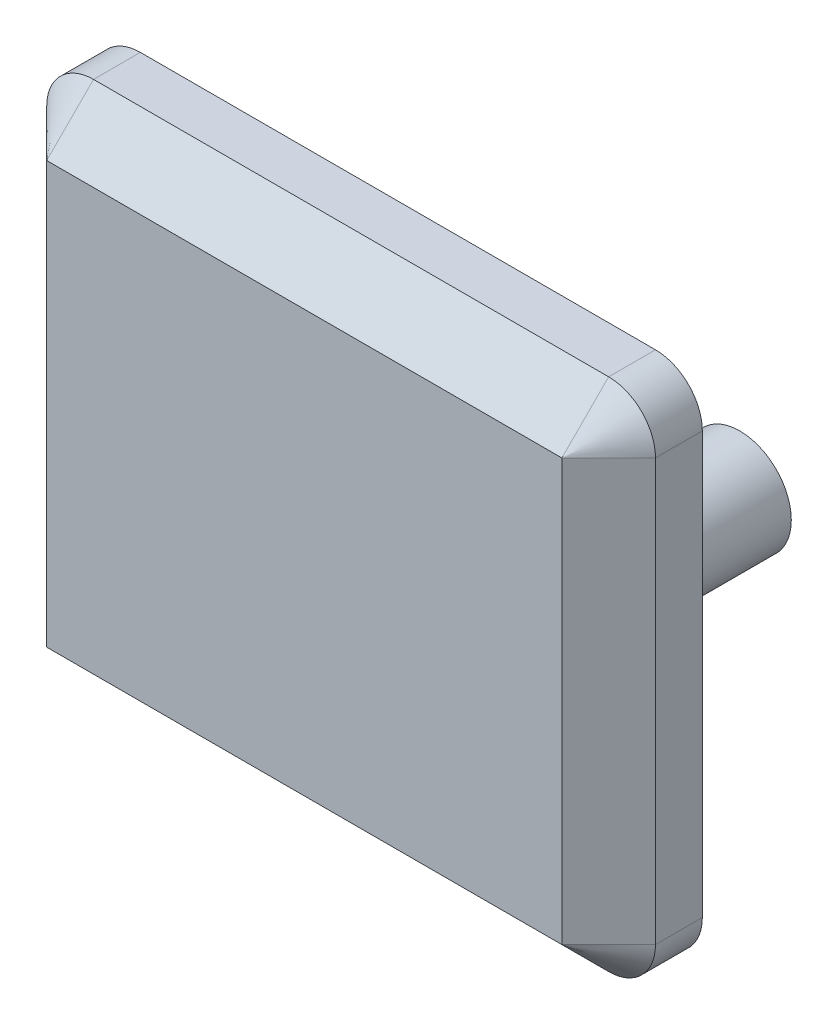
ISO-10303-21;
HEADER;
FILE_DESCRIPTION(('STEP AP214'),'2;1');
FILE_NAME('part.step','',(''),(''),'','','');
FILE_SCHEMA(('AUTOMOTIVE_DESIGN { 1 0 10303 214 1 1 1 1 }'));
ENDSEC;
DATA;
#1=APPLICATION_CONTEXT('core data for automotive mechanical design processes');
#2=APPLICATION_PROTOCOL_DEFINITION('international standard','automotive_design',2000,#1);
#3=PRODUCT_CONTEXT('',#1,'mechanical');
#4=PRODUCT('Part','Part','',(#3));
#5=PRODUCT_RELATED_PRODUCT_CATEGORY('part','',(#4));
#6=PRODUCT_DEFINITION_FORMATION('','',#4);
#7=PRODUCT_DEFINITION_CONTEXT('part definition',#1,'design');
#8=PRODUCT_DEFINITION('design','',#6,#7);
#9=PRODUCT_DEFINITION_SHAPE('','',#8);
#10=(LENGTH_UNIT() NAMED_UNIT(*) SI_UNIT(.MILLI.,.METRE.));
#11=(NAMED_UNIT(*) PLANE_ANGLE_UNIT() SI_UNIT($,.RADIAN.));
#12=(NAMED_UNIT(*) SI_UNIT($,.STERADIAN.) SOLID_ANGLE_UNIT());
#13=UNCERTAINTY_MEASURE_WITH_UNIT(LENGTH_MEASURE(1.E-05),#10,'distance_accuracy_value','');
#14=(GEOMETRIC_REPRESENTATION_CONTEXT(3) GLOBAL_UNCERTAINTY_ASSIGNED_CONTEXT((#13)) GLOBAL_UNIT_ASSIGNED_CONTEXT((#10,
#11,#12)) REPRESENTATION_CONTEXT('',''));
#15=CARTESIAN_POINT('',(0.,0.,0.));
#16=DIRECTION('',(0.,0.,1.));
#17=DIRECTION('',(1.,0.,0.));
#18=AXIS2_PLACEMENT_3D('',#15,#16,#17);
#19=CARTESIAN_POINT('',(-7.23762279861069,9.5943839209969,1.));
#20=DIRECTION('',(0.,0.,-1.));
#21=DIRECTION('',(-1.,0.,0.));
#22=AXIS2_PLACEMENT_3D('',#19,#20,#21);
#23=CYLINDRICAL_SURFACE('',#22,0.5);
#24=DIRECTION('',(0.,0.,-1.));
#25=VECTOR('',#24,1.);
#26=CARTESIAN_POINT('',(-7.2376227986107,10.0943839209969,1.));
#27=LINE('',#26,#25);
#28=CARTESIAN_POINT('',(-7.2376227986107,10.0943839209969,0.499999999999997));
#29=VERTEX_POINT('',#28);
#30=CARTESIAN_POINT('',(-7.2376227986107,10.0943839209969,0.));
#31=VERTEX_POINT('',#30);
#32=EDGE_CURVE('E121',#29,#31,#27,.T.);
#33=ORIENTED_EDGE('',*,*,#32,.F.);
#34=CARTESIAN_POINT('',(-7.23762279861069,9.5943839209969,0.499999999999997));
#35=DIRECTION('',(0.,0.,1.));
#36=DIRECTION('',(1.,0.,0.));
#37=AXIS2_PLACEMENT_3D('',#34,#35,#36);
#38=CIRCLE('',#37,0.5);
#39=CARTESIAN_POINT('',(-6.73762279861069,9.5943839209969,0.499999999999997));
#40=VERTEX_POINT('',#39);
#41=EDGE_CURVE('E193',#29,#40,#38,.F.);
#42=ORIENTED_EDGE('',*,*,#41,.T.);
#43=DIRECTION('',(0.,0.,-1.));
#44=VECTOR('',#43,1.);
#45=CARTESIAN_POINT('',(-6.73762279861069,9.5943839209969,1.));
#46=LINE('',#45,#44);
#47=CARTESIAN_POINT('',(-6.73762279861069,9.5943839209969,0.));
#48=VERTEX_POINT('',#47);
#49=EDGE_CURVE('E144',#40,#48,#46,.T.);
#50=ORIENTED_EDGE('',*,*,#49,.T.);
#51=CARTESIAN_POINT('',(-7.23762279861069,9.5943839209969,0.));
#52=DIRECTION('',(0.,0.,1.));
#53=DIRECTION('',(1.,0.,0.));
#54=AXIS2_PLACEMENT_3D('',#51,#52,#53);
#55=CIRCLE('',#54,0.5);
#56=EDGE_CURVE('E138',#48,#31,#55,.T.);
#57=ORIENTED_EDGE('',*,*,#56,.T.);
#58=EDGE_LOOP('',(#33,#42,#50,#57));
#59=FACE_BOUND('',#58,.T.);
#60=ADVANCED_FACE('F41',(#59),#23,.T.);
#61=CARTESIAN_POINT('',(-7.2376227986107,10.0943839209969,1.));
#62=DIRECTION('',(0.,-1.,0.));
#63=DIRECTION('',(1.,0.,0.));
#64=AXIS2_PLACEMENT_3D('',#61,#62,#63);
#65=PLANE('',#64);
#66=DIRECTION('',(0.,0.,-1.));
#67=VECTOR('',#66,1.);
#68=CARTESIAN_POINT('',(-12.7376227986107,10.0943839209969,1.));
#69=LINE('',#68,#67);
#70=CARTESIAN_POINT('',(-12.7376227986107,10.0943839209969,0.499999999999997));
#71=VERTEX_POINT('',#70);
#72=CARTESIAN_POINT('',(-12.7376227986107,10.0943839209969,0.));
#73=VERTEX_POINT('',#72);
#74=EDGE_CURVE('E132',#71,#73,#69,.T.);
#75=ORIENTED_EDGE('',*,*,#74,.F.);
#76=DIRECTION('',(1.,0.,0.));
#77=VECTOR('',#76,1.);
#78=CARTESIAN_POINT('',(-7.2376227986107,10.0943839209969,0.499999999999997));
#79=LINE('',#78,#77);
#80=EDGE_CURVE('E128',#71,#29,#79,.T.);
#81=ORIENTED_EDGE('',*,*,#80,.T.);
#82=ORIENTED_EDGE('',*,*,#32,.T.);
#83=DIRECTION('',(-1.,0.,0.));
#84=VECTOR('',#83,1.);
#85=CARTESIAN_POINT('',(-7.2376227986107,10.0943839209969,0.));
#86=LINE('',#85,#84);
#87=EDGE_CURVE('E125',#31,#73,#86,.T.);
#88=ORIENTED_EDGE('',*,*,#87,.T.);
#89=EDGE_LOOP('',(#75,#81,#82,#88));
#90=FACE_BOUND('',#89,.T.);
#91=ADVANCED_FACE('F124',(#90),#65,.F.);
#92=CARTESIAN_POINT('',(-12.7376227986107,9.5943839209969,1.));
#93=DIRECTION('',(0.,0.,-1.));
#94=DIRECTION('',(-1.,0.,0.));
#95=AXIS2_PLACEMENT_3D('',#92,#93,#94);
#96=CYLINDRICAL_SURFACE('',#95,0.5);
#97=DIRECTION('',(0.,0.,-1.));
#98=VECTOR('',#97,1.);
#99=CARTESIAN_POINT('',(-13.2376227986107,9.5943839209969,1.));
#100=LINE('',#99,#98);
#101=CARTESIAN_POINT('',(-13.2376227986107,9.5943839209969,0.499999999999997));
#102=VERTEX_POINT('',#101);
#103=CARTESIAN_POINT('',(-13.2376227986107,9.5943839209969,0.));
#104=VERTEX_POINT('',#103);
#105=EDGE_CURVE('E179',#102,#104,#100,.T.);
#106=ORIENTED_EDGE('',*,*,#105,.F.);
#107=CARTESIAN_POINT('',(-12.7376227986107,9.5943839209969,0.499999999999997));
#108=DIRECTION('',(0.,0.,1.));
#109=DIRECTION('',(1.,0.,0.));
#110=AXIS2_PLACEMENT_3D('',#107,#108,#109);
#111=CIRCLE('',#110,0.5);
#112=EDGE_CURVE('E191',#102,#71,#111,.F.);
#113=ORIENTED_EDGE('',*,*,#112,.T.);
#114=ORIENTED_EDGE('',*,*,#74,.T.);
#115=CARTESIAN_POINT('',(-12.7376227986107,9.5943839209969,0.));
#116=DIRECTION('',(0.,0.,1.));
#117=DIRECTION('',(1.,0.,0.));
#118=AXIS2_PLACEMENT_3D('',#115,#116,#117);
#119=CIRCLE('',#118,0.5);
#120=EDGE_CURVE('E141',#73,#104,#119,.T.);
#121=ORIENTED_EDGE('',*,*,#120,.T.);
#122=EDGE_LOOP('',(#106,#113,#114,#121));
#123=FACE_BOUND('',#122,.T.);
#124=ADVANCED_FACE('F245',(#123),#96,.T.);
#125=CARTESIAN_POINT('',(-13.2376227986107,5.09438392099691,1.));
#126=DIRECTION('',(1.,0.,0.));
#127=DIRECTION('',(0.,0.,-1.));
#128=AXIS2_PLACEMENT_3D('',#125,#126,#127);
#129=PLANE('',#128);
#130=DIRECTION('',(0.,0.,-1.));
#131=VECTOR('',#130,1.);
#132=CARTESIAN_POINT('',(-13.2376227986107,5.0943839209969,1.));
#133=LINE('',#132,#131);
#134=CARTESIAN_POINT('',(-13.2376227986107,5.0943839209969,0.499999999999997));
#135=VERTEX_POINT('',#134);
#136=CARTESIAN_POINT('',(-13.2376227986107,5.0943839209969,0.));
#137=VERTEX_POINT('',#136);
#138=EDGE_CURVE('E177',#135,#137,#133,.T.);
#139=ORIENTED_EDGE('',*,*,#138,.F.);
#140=DIRECTION('',(0.,1.,0.));
#141=VECTOR('',#140,1.);
#142=CARTESIAN_POINT('',(-13.2376227986107,9.5943839209969,0.499999999999997));
#143=LINE('',#142,#141);
#144=EDGE_CURVE('E195',#135,#102,#143,.T.);
#145=ORIENTED_EDGE('',*,*,#144,.T.);
#146=ORIENTED_EDGE('',*,*,#105,.T.);
#147=DIRECTION('',(0.,-1.,0.));
#148=VECTOR('',#147,1.);
#149=CARTESIAN_POINT('',(-13.2376227986107,5.09438392099691,0.));
#150=LINE('',#149,#148);
#151=EDGE_CURVE('E156',#104,#137,#150,.T.);
#152=ORIENTED_EDGE('',*,*,#151,.T.);
#153=EDGE_LOOP('',(#139,#145,#146,#152));
#154=FACE_BOUND('',#153,.T.);
#155=ADVANCED_FACE('F309',(#154),#129,.F.);
#156=CARTESIAN_POINT('',(-12.7376227986107,5.0943839209969,1.));
#157=DIRECTION('',(0.,0.,-1.));
#158=DIRECTION('',(-1.,0.,0.));
#159=AXIS2_PLACEMENT_3D('',#156,#157,#158);
#160=CYLINDRICAL_SURFACE('',#159,0.5);
#161=DIRECTION('',(0.,0.,-1.));
#162=VECTOR('',#161,1.);
#163=CARTESIAN_POINT('',(-12.7376227986107,4.5943839209969,1.));
#164=LINE('',#163,#162);
#165=CARTESIAN_POINT('',(-12.7376227986107,4.5943839209969,0.499999999999997));
#166=VERTEX_POINT('',#165);
#167=CARTESIAN_POINT('',(-12.7376227986107,4.5943839209969,0.));
#168=VERTEX_POINT('',#167);
#169=EDGE_CURVE('E175',#166,#168,#164,.T.);
#170=ORIENTED_EDGE('',*,*,#169,.F.);
#171=CARTESIAN_POINT('',(-12.7376227986107,5.0943839209969,0.499999999999997));
#172=DIRECTION('',(0.,0.,1.));
#173=DIRECTION('',(1.,0.,0.));
#174=AXIS2_PLACEMENT_3D('',#171,#172,#173);
#175=CIRCLE('',#174,0.5);
#176=EDGE_CURVE('E199',#166,#135,#175,.F.);
#177=ORIENTED_EDGE('',*,*,#176,.T.);
#178=ORIENTED_EDGE('',*,*,#138,.T.);
#179=CARTESIAN_POINT('',(-12.7376227986107,5.0943839209969,0.));
#180=DIRECTION('',(0.,0.,1.));
#181=DIRECTION('',(-1.,0.,0.));
#182=AXIS2_PLACEMENT_3D('',#179,#180,#181);
#183=CIRCLE('',#182,0.5);
#184=EDGE_CURVE('E159',#137,#168,#183,.T.);
#185=ORIENTED_EDGE('',*,*,#184,.T.);
#186=EDGE_LOOP('',(#170,#177,#178,#185));
#187=FACE_BOUND('',#186,.T.);
#188=ADVANCED_FACE('F307',(#187),#160,.T.);
#189=CARTESIAN_POINT('',(-7.2376227986107,4.5943839209969,1.));
#190=DIRECTION('',(0.,1.,0.));
#191=DIRECTION('',(0.,0.,1.));
#192=AXIS2_PLACEMENT_3D('',#189,#190,#191);
#193=PLANE('',#192);
#194=DIRECTION('',(0.,0.,-1.));
#195=VECTOR('',#194,1.);
#196=CARTESIAN_POINT('',(-7.2376227986107,4.5943839209969,1.));
#197=LINE('',#196,#195);
#198=CARTESIAN_POINT('',(-7.2376227986107,4.5943839209969,0.499999999999997));
#199=VERTEX_POINT('',#198);
#200=CARTESIAN_POINT('',(-7.2376227986107,4.5943839209969,0.));
#201=VERTEX_POINT('',#200);
#202=EDGE_CURVE('E173',#199,#201,#197,.T.);
#203=ORIENTED_EDGE('',*,*,#202,.F.);
#204=DIRECTION('',(-1.,0.,0.));
#205=VECTOR('',#204,1.);
#206=CARTESIAN_POINT('',(-12.7376227986107,4.5943839209969,0.499999999999997));
#207=LINE('',#206,#205);
#208=EDGE_CURVE('E64',#199,#166,#207,.T.);
#209=ORIENTED_EDGE('',*,*,#208,.T.);
#210=ORIENTED_EDGE('',*,*,#169,.T.);
#211=DIRECTION('',(1.,0.,0.));
#212=VECTOR('',#211,1.);
#213=CARTESIAN_POINT('',(-7.2376227986107,4.5943839209969,0.));
#214=LINE('',#213,#212);
#215=EDGE_CURVE('E162',#168,#201,#214,.T.);
#216=ORIENTED_EDGE('',*,*,#215,.T.);
#217=EDGE_LOOP('',(#203,#209,#210,#216));
#218=FACE_BOUND('',#217,.T.);
#219=ADVANCED_FACE('F314',(#218),#193,.F.);
#220=CARTESIAN_POINT('',(-7.23762279861069,5.0943839209969,1.));
#221=DIRECTION('',(0.,0.,-1.));
#222=DIRECTION('',(-1.,0.,0.));
#223=AXIS2_PLACEMENT_3D('',#220,#221,#222);
#224=CYLINDRICAL_SURFACE('',#223,0.5);
#225=DIRECTION('',(0.,0.,-1.));
#226=VECTOR('',#225,1.);
#227=CARTESIAN_POINT('',(-6.73762279861069,5.09438392099691,1.));
#228=LINE('',#227,#226);
#229=CARTESIAN_POINT('',(-6.73762279861069,5.09438392099691,0.499999999999997));
#230=VERTEX_POINT('',#229);
#231=CARTESIAN_POINT('',(-6.73762279861069,5.09438392099691,0.));
#232=VERTEX_POINT('',#231);
#233=EDGE_CURVE('E171',#230,#232,#228,.T.);
#234=ORIENTED_EDGE('',*,*,#233,.F.);
#235=CARTESIAN_POINT('',(-7.23762279861069,5.0943839209969,0.499999999999997));
#236=DIRECTION('',(0.,0.,1.));
#237=DIRECTION('',(1.,0.,0.));
#238=AXIS2_PLACEMENT_3D('',#235,#236,#237);
#239=CIRCLE('',#238,0.5);
#240=EDGE_CURVE('E57',#230,#199,#239,.F.);
#241=ORIENTED_EDGE('',*,*,#240,.T.);
#242=ORIENTED_EDGE('',*,*,#202,.T.);
#243=CARTESIAN_POINT('',(-7.23762279861069,5.0943839209969,0.));
#244=DIRECTION('',(0.,0.,1.));
#245=DIRECTION('',(1.,0.,0.));
#246=AXIS2_PLACEMENT_3D('',#243,#244,#245);
#247=CIRCLE('',#246,0.5);
#248=EDGE_CURVE('E165',#201,#232,#247,.T.);
#249=ORIENTED_EDGE('',*,*,#248,.T.);
#250=EDGE_LOOP('',(#234,#241,#242,#249));
#251=FACE_BOUND('',#250,.T.);
#252=ADVANCED_FACE('F315',(#251),#224,.T.);
#253=CARTESIAN_POINT('',(-6.73762279861069,5.09438392099691,1.));
#254=DIRECTION('',(-1.,0.,0.));
#255=DIRECTION('',(0.,0.,1.));
#256=AXIS2_PLACEMENT_3D('',#253,#254,#255);
#257=PLANE('',#256);
#258=ORIENTED_EDGE('',*,*,#49,.F.);
#259=DIRECTION('',(0.,-1.,0.));
#260=VECTOR('',#259,1.);
#261=CARTESIAN_POINT('',(-6.73762279861069,5.09438392099691,0.499999999999997));
#262=LINE('',#261,#260);
#263=EDGE_CURVE('E197',#40,#230,#262,.T.);
#264=ORIENTED_EDGE('',*,*,#263,.T.);
#265=ORIENTED_EDGE('',*,*,#233,.T.);
#266=DIRECTION('',(0.,1.,0.));
#267=VECTOR('',#266,1.);
#268=CARTESIAN_POINT('',(-6.73762279861069,5.09438392099691,0.));
#269=LINE('',#268,#267);
#270=EDGE_CURVE('E168',#232,#48,#269,.T.);
#271=ORIENTED_EDGE('',*,*,#270,.T.);
#272=EDGE_LOOP('',(#258,#264,#265,#271));
#273=FACE_BOUND('',#272,.T.);
#274=ADVANCED_FACE('F235',(#273),#257,.F.);
#275=CARTESIAN_POINT('',(-7.23762279861069,9.5943839209969,1.));
#276=DIRECTION('',(0.,0.,1.));
#277=DIRECTION('',(1.,0.,0.));
#278=AXIS2_PLACEMENT_3D('',#275,#276,#277);
#279=PLANE('',#278);
#280=DIRECTION('',(0.,1.,0.));
#281=VECTOR('',#280,1.);
#282=CARTESIAN_POINT('',(-7.2376227986107,9.5943839209969,1.));
#283=LINE('',#282,#281);
#284=CARTESIAN_POINT('',(-7.23762279861069,5.0943839209969,1.));
#285=VERTEX_POINT('',#284);
#286=CARTESIAN_POINT('',(-7.2376227986107,9.5943839209969,1.));
#287=VERTEX_POINT('',#286);
#288=EDGE_CURVE('E183',#285,#287,#283,.T.);
#289=ORIENTED_EDGE('',*,*,#288,.T.);
#290=DIRECTION('',(-1.,0.,0.));
#291=VECTOR('',#290,1.);
#292=CARTESIAN_POINT('',(-12.7376227986107,9.5943839209969,1.));
#293=LINE('',#292,#291);
#294=CARTESIAN_POINT('',(-12.7376227986107,9.5943839209969,1.));
#295=VERTEX_POINT('',#294);
#296=EDGE_CURVE('E187',#287,#295,#293,.T.);
#297=ORIENTED_EDGE('',*,*,#296,.T.);
#298=DIRECTION('',(0.,-1.,0.));
#299=VECTOR('',#298,1.);
#300=CARTESIAN_POINT('',(-12.7376227986107,5.0943839209969,1.));
#301=LINE('',#300,#299);
#302=CARTESIAN_POINT('',(-12.7376227986107,5.0943839209969,1.));
#303=VERTEX_POINT('',#302);
#304=EDGE_CURVE('E185',#295,#303,#301,.T.);
#305=ORIENTED_EDGE('',*,*,#304,.T.);
#306=DIRECTION('',(1.,0.,0.));
#307=VECTOR('',#306,1.);
#308=CARTESIAN_POINT('',(-7.2376227986107,5.0943839209969,1.));
#309=LINE('',#308,#307);
#310=EDGE_CURVE('E131',#303,#285,#309,.T.);
#311=ORIENTED_EDGE('',*,*,#310,.T.);
#312=EDGE_LOOP('',(#289,#297,#305,#311));
#313=FACE_BOUND('',#312,.T.);
#314=ADVANCED_FACE('F226',(#313),#279,.T.);
#315=CARTESIAN_POINT('',(-7.23762279861069,9.5943839209969,0.));
#316=DIRECTION('',(0.,0.,1.));
#317=DIRECTION('',(1.,0.,0.));
#318=AXIS2_PLACEMENT_3D('',#315,#316,#317);
#319=PLANE('',#318);
#320=CARTESIAN_POINT('',(-8.2376227986107,7.3443839209969,0.));
#321=DIRECTION('',(0.,0.,1.));
#322=DIRECTION('',(1.,0.,0.));
#323=AXIS2_PLACEMENT_3D('',#320,#321,#322);
#324=CIRCLE('',#323,0.55);
#325=CARTESIAN_POINT('',(-7.6876227986107,7.3443839209969,0.));
#326=VERTEX_POINT('',#325);
#327=EDGE_CURVE('E11',#326,#326,#324,.F.);
#328=ORIENTED_EDGE('',*,*,#327,.F.);
#329=EDGE_LOOP('',(#328));
#330=FACE_BOUND('',#329,.T.);
#331=CARTESIAN_POINT('',(-11.7376227986107,7.34438392099691,0.));
#332=DIRECTION('',(0.,0.,1.));
#333=DIRECTION('',(1.,0.,0.));
#334=AXIS2_PLACEMENT_3D('',#331,#332,#333);
#335=CIRCLE('',#334,0.55);
#336=CARTESIAN_POINT('',(-11.1876227986107,7.34438392099691,0.));
#337=VERTEX_POINT('',#336);
#338=EDGE_CURVE('E50',#337,#337,#335,.F.);
#339=ORIENTED_EDGE('',*,*,#338,.F.);
#340=EDGE_LOOP('',(#339));
#341=FACE_BOUND('',#340,.T.);
#342=ORIENTED_EDGE('',*,*,#56,.F.);
#343=ORIENTED_EDGE('',*,*,#270,.F.);
#344=ORIENTED_EDGE('',*,*,#248,.F.);
#345=ORIENTED_EDGE('',*,*,#215,.F.);
#346=ORIENTED_EDGE('',*,*,#184,.F.);
#347=ORIENTED_EDGE('',*,*,#151,.F.);
#348=ORIENTED_EDGE('',*,*,#120,.F.);
#349=ORIENTED_EDGE('',*,*,#87,.F.);
#350=EDGE_LOOP('',(#342,#343,#344,#345,#346,#347,#348,#349));
#351=FACE_BOUND('',#350,.T.);
#352=ADVANCED_FACE('F136',(#330,#341,#351),#319,.F.);
#353=CARTESIAN_POINT('',(-7.23762279861069,5.0943839209969,1.));
#354=DIRECTION('',(0.,-0.707106781186549,0.707106781186546));
#355=DIRECTION('',(-1.,0.,0.));
#356=AXIS2_PLACEMENT_3D('',#353,#354,#355);
#357=PLANE('',#356);
#358=DIRECTION('',(0.,0.707106781186546,0.707106781186549));
#359=VECTOR('',#358,1.);
#360=CARTESIAN_POINT('',(-12.7376227986107,4.5943839209969,0.499999999999997));
#361=LINE('',#360,#359);
#362=EDGE_CURVE('E149',#166,#303,#361,.T.);
#363=ORIENTED_EDGE('',*,*,#362,.F.);
#364=ORIENTED_EDGE('',*,*,#208,.F.);
#365=DIRECTION('',(0.,-0.707106781186546,-0.707106781186549));
#366=VECTOR('',#365,1.);
#367=CARTESIAN_POINT('',(-7.23762279861069,5.0943839209969,1.));
#368=LINE('',#367,#366);
#369=EDGE_CURVE('E146',#285,#199,#368,.T.);
#370=ORIENTED_EDGE('',*,*,#369,.F.);
#371=ORIENTED_EDGE('',*,*,#310,.F.);
#372=EDGE_LOOP('',(#363,#364,#370,#371));
#373=FACE_BOUND('',#372,.T.);
#374=ADVANCED_FACE('F44',(#373),#357,.T.);
#375=CARTESIAN_POINT('',(-7.23762279861069,5.0943839209969,0.499999999999997));
#376=DIRECTION('',(0.,0.,-1.));
#377=DIRECTION('',(-1.,0.,0.));
#378=AXIS2_PLACEMENT_3D('',#375,#376,#377);
#379=CONICAL_SURFACE('',#378,0.5,0.785398163397446);
#380=ORIENTED_EDGE('',*,*,#369,.T.);
#381=ORIENTED_EDGE('',*,*,#240,.F.);
#382=DIRECTION('',(0.707106781186546,0.,-0.707106781186549));
#383=VECTOR('',#382,1.);
#384=CARTESIAN_POINT('',(-7.2376227986107,5.09438392099691,1.));
#385=LINE('',#384,#383);
#386=EDGE_CURVE('E216',#285,#230,#385,.T.);
#387=ORIENTED_EDGE('',*,*,#386,.F.);
#388=EDGE_LOOP('',(#380,#381,#387));
#389=FACE_BOUND('',#388,.T.);
#390=ADVANCED_FACE('F233',(#389),#379,.T.);
#391=CARTESIAN_POINT('',(-12.7376227986107,5.0943839209969,0.499999999999997));
#392=DIRECTION('',(0.,0.,-1.));
#393=DIRECTION('',(-1.,0.,0.));
#394=AXIS2_PLACEMENT_3D('',#391,#392,#393);
#395=CONICAL_SURFACE('',#394,0.5,0.785398163397446);
#396=ORIENTED_EDGE('',*,*,#176,.F.);
#397=ORIENTED_EDGE('',*,*,#362,.T.);
#398=DIRECTION('',(0.707106781186546,0.,0.707106781186549));
#399=VECTOR('',#398,1.);
#400=CARTESIAN_POINT('',(-13.2376227986107,5.0943839209969,0.499999999999997));
#401=LINE('',#400,#399);
#402=EDGE_CURVE('E213',#135,#303,#401,.T.);
#403=ORIENTED_EDGE('',*,*,#402,.F.);
#404=EDGE_LOOP('',(#396,#397,#403));
#405=FACE_BOUND('',#404,.T.);
#406=ADVANCED_FACE('F284',(#405),#395,.T.);
#407=CARTESIAN_POINT('',(-7.2376227986107,9.5943839209969,1.));
#408=DIRECTION('',(0.707106781186549,0.,0.707106781186546));
#409=DIRECTION('',(0.,-1.,0.));
#410=AXIS2_PLACEMENT_3D('',#407,#408,#409);
#411=PLANE('',#410);
#412=ORIENTED_EDGE('',*,*,#386,.T.);
#413=ORIENTED_EDGE('',*,*,#263,.F.);
#414=DIRECTION('',(0.707106781186546,0.,-0.707106781186549));
#415=VECTOR('',#414,1.);
#416=CARTESIAN_POINT('',(-7.2376227986107,9.5943839209969,1.));
#417=LINE('',#416,#415);
#418=EDGE_CURVE('E210',#287,#40,#417,.T.);
#419=ORIENTED_EDGE('',*,*,#418,.F.);
#420=ORIENTED_EDGE('',*,*,#288,.F.);
#421=EDGE_LOOP('',(#412,#413,#419,#420));
#422=FACE_BOUND('',#421,.T.);
#423=ADVANCED_FACE('F277',(#422),#411,.T.);
#424=CARTESIAN_POINT('',(-12.7376227986107,9.5943839209969,1.));
#425=DIRECTION('',(-0.707106781186549,0.,0.707106781186546));
#426=DIRECTION('',(0.,1.,0.));
#427=AXIS2_PLACEMENT_3D('',#424,#425,#426);
#428=PLANE('',#427);
#429=ORIENTED_EDGE('',*,*,#402,.T.);
#430=ORIENTED_EDGE('',*,*,#304,.F.);
#431=DIRECTION('',(0.707106781186546,0.,0.707106781186549));
#432=VECTOR('',#431,1.);
#433=CARTESIAN_POINT('',(-13.2376227986107,9.5943839209969,0.499999999999997));
#434=LINE('',#433,#432);
#435=EDGE_CURVE('E207',#102,#295,#434,.T.);
#436=ORIENTED_EDGE('',*,*,#435,.F.);
#437=ORIENTED_EDGE('',*,*,#144,.F.);
#438=EDGE_LOOP('',(#429,#430,#436,#437));
#439=FACE_BOUND('',#438,.T.);
#440=ADVANCED_FACE('F270',(#439),#428,.T.);
#441=CARTESIAN_POINT('',(-7.23762279861069,9.5943839209969,0.499999999999997));
#442=DIRECTION('',(0.,0.,-1.));
#443=DIRECTION('',(-1.,0.,0.));
#444=AXIS2_PLACEMENT_3D('',#441,#442,#443);
#445=CONICAL_SURFACE('',#444,0.5,0.785398163397446);
#446=ORIENTED_EDGE('',*,*,#418,.T.);
#447=ORIENTED_EDGE('',*,*,#41,.F.);
#448=DIRECTION('',(0.,0.707106781186546,-0.707106781186549));
#449=VECTOR('',#448,1.);
#450=CARTESIAN_POINT('',(-7.2376227986107,9.5943839209969,1.));
#451=LINE('',#450,#449);
#452=EDGE_CURVE('E205',#287,#29,#451,.T.);
#453=ORIENTED_EDGE('',*,*,#452,.F.);
#454=EDGE_LOOP('',(#446,#447,#453));
#455=FACE_BOUND('',#454,.T.);
#456=ADVANCED_FACE('F263',(#455),#445,.T.);
#457=CARTESIAN_POINT('',(-12.7376227986107,9.5943839209969,0.499999999999997));
#458=DIRECTION('',(0.,0.,-1.));
#459=DIRECTION('',(-1.,0.,0.));
#460=AXIS2_PLACEMENT_3D('',#457,#458,#459);
#461=CONICAL_SURFACE('',#460,0.5,0.785398163397446);
#462=ORIENTED_EDGE('',*,*,#112,.F.);
#463=ORIENTED_EDGE('',*,*,#435,.T.);
#464=DIRECTION('',(0.,-0.707106781186546,0.707106781186549));
#465=VECTOR('',#464,1.);
#466=CARTESIAN_POINT('',(-12.7376227986107,10.0943839209969,0.499999999999997));
#467=LINE('',#466,#465);
#468=EDGE_CURVE('E203',#71,#295,#467,.T.);
#469=ORIENTED_EDGE('',*,*,#468,.F.);
#470=EDGE_LOOP('',(#462,#463,#469));
#471=FACE_BOUND('',#470,.T.);
#472=ADVANCED_FACE('F256',(#471),#461,.T.);
#473=CARTESIAN_POINT('',(-7.23762279861069,9.5943839209969,1.));
#474=DIRECTION('',(0.,0.707106781186549,0.707106781186546));
#475=DIRECTION('',(1.,0.,0.));
#476=AXIS2_PLACEMENT_3D('',#473,#474,#475);
#477=PLANE('',#476);
#478=ORIENTED_EDGE('',*,*,#452,.T.);
#479=ORIENTED_EDGE('',*,*,#80,.F.);
#480=ORIENTED_EDGE('',*,*,#468,.T.);
#481=ORIENTED_EDGE('',*,*,#296,.F.);
#482=EDGE_LOOP('',(#478,#479,#480,#481));
#483=FACE_BOUND('',#482,.T.);
#484=ADVANCED_FACE('F250',(#483),#477,.T.);
#485=CARTESIAN_POINT('',(-11.7376227986107,7.34438392099691,-1.9));
#486=DIRECTION('',(0.,0.,1.));
#487=DIRECTION('',(1.,0.,0.));
#488=AXIS2_PLACEMENT_3D('',#485,#486,#487);
#489=CYLINDRICAL_SURFACE('',#488,0.55);
#490=CARTESIAN_POINT('',(-11.7376227986107,7.34438392099691,-1.9));
#491=DIRECTION('',(0.,0.,-1.));
#492=DIRECTION('',(-1.,0.,0.));
#493=AXIS2_PLACEMENT_3D('',#490,#491,#492);
#494=CIRCLE('',#493,0.55);
#495=CARTESIAN_POINT('',(-12.2876227986107,7.34438392099691,-1.9));
#496=VERTEX_POINT('',#495);
#497=EDGE_CURVE('E152',#496,#496,#494,.T.);
#498=ORIENTED_EDGE('',*,*,#497,.F.);
#499=EDGE_LOOP('',(#498));
#500=FACE_BOUND('',#499,.T.);
#501=ORIENTED_EDGE('',*,*,#338,.T.);
#502=EDGE_LOOP('',(#501));
#503=FACE_BOUND('',#502,.T.);
#504=ADVANCED_FACE('F223',(#500,#503),#489,.T.);
#505=CARTESIAN_POINT('',(-11.7376227986107,7.34438392099691,-1.9));
#506=DIRECTION('',(0.,0.,-1.));
#507=DIRECTION('',(-1.,0.,0.));
#508=AXIS2_PLACEMENT_3D('',#505,#506,#507);
#509=PLANE('',#508);
#510=ORIENTED_EDGE('',*,*,#497,.T.);
#511=EDGE_LOOP('',(#510));
#512=FACE_BOUND('',#511,.T.);
#513=ADVANCED_FACE('F416',(#512),#509,.T.);
#514=CARTESIAN_POINT('',(-8.2376227986107,7.3443839209969,-1.9));
#515=DIRECTION('',(0.,0.,1.));
#516=DIRECTION('',(1.,0.,0.));
#517=AXIS2_PLACEMENT_3D('',#514,#515,#516);
#518=CYLINDRICAL_SURFACE('',#517,0.55);
#519=CARTESIAN_POINT('',(-8.2376227986107,7.3443839209969,-1.9));
#520=DIRECTION('',(0.,0.,-1.));
#521=DIRECTION('',(-1.,0.,0.));
#522=AXIS2_PLACEMENT_3D('',#519,#520,#521);
#523=CIRCLE('',#522,0.55);
#524=CARTESIAN_POINT('',(-8.78762279861069,7.3443839209969,-1.9));
#525=VERTEX_POINT('',#524);
#526=EDGE_CURVE('E524',#525,#525,#523,.T.);
#527=ORIENTED_EDGE('',*,*,#526,.F.);
#528=EDGE_LOOP('',(#527));
#529=FACE_BOUND('',#528,.T.);
#530=ORIENTED_EDGE('',*,*,#327,.T.);
#531=EDGE_LOOP('',(#530));
#532=FACE_BOUND('',#531,.T.);
#533=ADVANCED_FACE('F427',(#529,#532),#518,.T.);
#534=CARTESIAN_POINT('',(-8.2376227986107,7.3443839209969,-1.9));
#535=DIRECTION('',(0.,0.,-1.));
#536=DIRECTION('',(-1.,0.,0.));
#537=AXIS2_PLACEMENT_3D('',#534,#535,#536);
#538=PLANE('',#537);
#539=ORIENTED_EDGE('',*,*,#526,.T.);
#540=EDGE_LOOP('',(#539));
#541=FACE_BOUND('',#540,.T.);
#542=ADVANCED_FACE('F438',(#541),#538,.T.);
#543=CLOSED_SHELL('',(#60,#91,#124,#155,#188,#219,#252,#274,#314,#352,#374,#390,#406,#423,#440,
#456,#472,#484,#504,#513,#533,#542));
#544=MANIFOLD_SOLID_BREP('B2',#543);
#545=ADVANCED_BREP_SHAPE_REPRESENTATION('',(#18,#544),#14);
#546=SHAPE_DEFINITION_REPRESENTATION(#9,#545);
ENDSEC;
END-ISO-10303-21;
